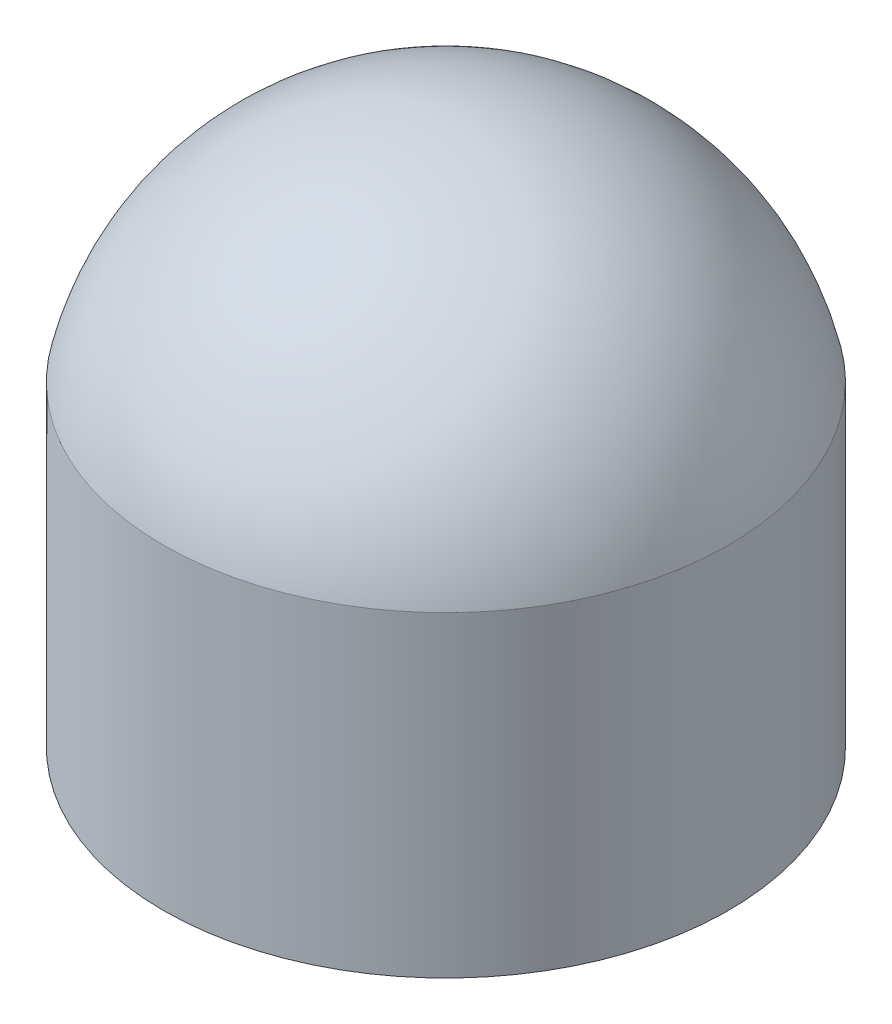
ISO-10303-21;
HEADER;
FILE_DESCRIPTION(('STEP AP214'),'2;1');
FILE_NAME('part.step','',(''),(''),'','','');
FILE_SCHEMA(('AUTOMOTIVE_DESIGN { 1 0 10303 214 1 1 1 1 }'));
ENDSEC;
DATA;
#1=APPLICATION_CONTEXT('core data for automotive mechanical design processes');
#2=APPLICATION_PROTOCOL_DEFINITION('international standard','automotive_design',2000,#1);
#3=PRODUCT_CONTEXT('',#1,'mechanical');
#4=PRODUCT('Part','Part','',(#3));
#5=PRODUCT_RELATED_PRODUCT_CATEGORY('part','',(#4));
#6=PRODUCT_DEFINITION_FORMATION('','',#4);
#7=PRODUCT_DEFINITION_CONTEXT('part definition',#1,'design');
#8=PRODUCT_DEFINITION('design','',#6,#7);
#9=PRODUCT_DEFINITION_SHAPE('','',#8);
#10=(LENGTH_UNIT() NAMED_UNIT(*) SI_UNIT(.MILLI.,.METRE.));
#11=(NAMED_UNIT(*) PLANE_ANGLE_UNIT() SI_UNIT($,.RADIAN.));
#12=(NAMED_UNIT(*) SI_UNIT($,.STERADIAN.) SOLID_ANGLE_UNIT());
#13=UNCERTAINTY_MEASURE_WITH_UNIT(LENGTH_MEASURE(1.E-05),#10,'distance_accuracy_value','');
#14=(GEOMETRIC_REPRESENTATION_CONTEXT(3) GLOBAL_UNCERTAINTY_ASSIGNED_CONTEXT((#13)) GLOBAL_UNIT_ASSIGNED_CONTEXT((#10,
#11,#12)) REPRESENTATION_CONTEXT('',''));
#15=CARTESIAN_POINT('',(0.,0.,0.));
#16=DIRECTION('',(0.,0.,1.));
#17=DIRECTION('',(1.,0.,0.));
#18=AXIS2_PLACEMENT_3D('',#15,#16,#17);
#19=CARTESIAN_POINT('',(0.,1.4,0.));
#20=DIRECTION('',(0.,-1.,0.));
#21=DIRECTION('',(0.,0.,-1.));
#22=AXIS2_PLACEMENT_3D('',#19,#20,#21);
#23=CYLINDRICAL_SURFACE('',#22,1.25);
#24=CARTESIAN_POINT('',(0.,1.4,0.));
#25=DIRECTION('',(0.,1.,0.));
#26=DIRECTION('',(0.,0.,1.));
#27=AXIS2_PLACEMENT_3D('',#24,#25,#26);
#28=CIRCLE('',#27,1.25);
#29=CARTESIAN_POINT('',(0.,1.4,1.25));
#30=VERTEX_POINT('',#29);
#31=EDGE_CURVE('E10',#30,#30,#28,.T.);
#32=ORIENTED_EDGE('',*,*,#31,.F.);
#33=EDGE_LOOP('',(#32));
#34=FACE_BOUND('',#33,.T.);
#35=CARTESIAN_POINT('',(0.,0.,0.));
#36=DIRECTION('',(0.,1.,0.));
#37=DIRECTION('',(0.,0.,1.));
#38=AXIS2_PLACEMENT_3D('',#35,#36,#37);
#39=CIRCLE('',#38,1.25);
#40=CARTESIAN_POINT('',(0.,0.,1.25));
#41=VERTEX_POINT('',#40);
#42=EDGE_CURVE('E39',#41,#41,#39,.T.);
#43=ORIENTED_EDGE('',*,*,#42,.T.);
#44=EDGE_LOOP('',(#43));
#45=FACE_BOUND('',#44,.T.);
#46=ADVANCED_FACE('F32',(#34,#45),#23,.T.);
#47=CARTESIAN_POINT('',(0.,1.11875,0.));
#48=DIRECTION('',(0.,0.,1.));
#49=DIRECTION('',(1.,0.,0.));
#50=AXIS2_PLACEMENT_3D('',#47,#48,#49);
#51=SPHERICAL_SURFACE('',#50,1.28125);
#52=CARTESIAN_POINT('',(0.,1.11875,0.));
#53=DIRECTION('',(0.,1.,0.));
#54=DIRECTION('',(0.,0.,1.));
#55=AXIS2_PLACEMENT_3D('',#52,#53,#54);
#56=SPHERICAL_SURFACE('',#55,1.28125);
#57=ORIENTED_EDGE('',*,*,#31,.T.);
#58=EDGE_LOOP('',(#57));
#59=FACE_BOUND('',#58,.T.);
#60=ADVANCED_FACE('F34',(#59),#56,.T.);
#61=CARTESIAN_POINT('',(0.,0.,0.));
#62=DIRECTION('',(0.,1.,0.));
#63=DIRECTION('',(0.,0.,1.));
#64=AXIS2_PLACEMENT_3D('',#61,#62,#63);
#65=PLANE('',#64);
#66=ORIENTED_EDGE('',*,*,#42,.F.);
#67=EDGE_LOOP('',(#66));
#68=FACE_BOUND('',#67,.T.);
#69=ADVANCED_FACE('F46',(#68),#65,.F.);
#70=CLOSED_SHELL('',(#46,#60,#69));
#71=MANIFOLD_SOLID_BREP('B2',#70);
#72=ADVANCED_BREP_SHAPE_REPRESENTATION('',(#18,#71),#14);
#73=SHAPE_DEFINITION_REPRESENTATION(#9,#72);
ENDSEC;
END-ISO-10303-21;
